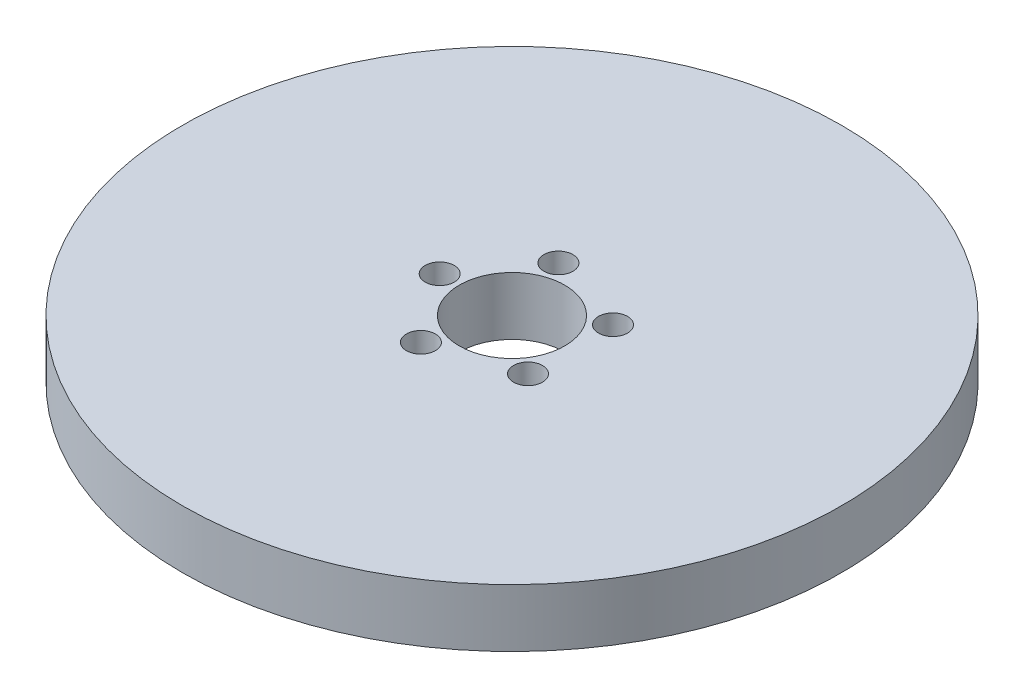
ISO-10303-21;
HEADER;
FILE_DESCRIPTION(('STEP AP214'),'2;1');
FILE_NAME('part.step','',(''),(''),'','','');
FILE_SCHEMA(('AUTOMOTIVE_DESIGN { 1 0 10303 214 1 1 1 1 }'));
ENDSEC;
DATA;
#1=APPLICATION_CONTEXT('core data for automotive mechanical design processes');
#2=APPLICATION_PROTOCOL_DEFINITION('international standard','automotive_design',2000,#1);
#3=PRODUCT_CONTEXT('',#1,'mechanical');
#4=PRODUCT('Part','Part','',(#3));
#5=PRODUCT_RELATED_PRODUCT_CATEGORY('part','',(#4));
#6=PRODUCT_DEFINITION_FORMATION('','',#4);
#7=PRODUCT_DEFINITION_CONTEXT('part definition',#1,'design');
#8=PRODUCT_DEFINITION('design','',#6,#7);
#9=PRODUCT_DEFINITION_SHAPE('','',#8);
#10=(LENGTH_UNIT() NAMED_UNIT(*) SI_UNIT(.MILLI.,.METRE.));
#11=(NAMED_UNIT(*) PLANE_ANGLE_UNIT() SI_UNIT($,.RADIAN.));
#12=(NAMED_UNIT(*) SI_UNIT($,.STERADIAN.) SOLID_ANGLE_UNIT());
#13=UNCERTAINTY_MEASURE_WITH_UNIT(LENGTH_MEASURE(1.E-05),#10,'distance_accuracy_value','');
#14=(GEOMETRIC_REPRESENTATION_CONTEXT(3) GLOBAL_UNCERTAINTY_ASSIGNED_CONTEXT((#13)) GLOBAL_UNIT_ASSIGNED_CONTEXT((#10,
#11,#12)) REPRESENTATION_CONTEXT('',''));
#15=CARTESIAN_POINT('',(0.,0.,0.));
#16=DIRECTION('',(0.,0.,1.));
#17=DIRECTION('',(1.,0.,0.));
#18=AXIS2_PLACEMENT_3D('',#15,#16,#17);
#19=CARTESIAN_POINT('',(0.,11.,0.));
#20=DIRECTION('',(0.,-1.,0.));
#21=DIRECTION('',(0.,0.,-1.));
#22=AXIS2_PLACEMENT_3D('',#19,#20,#21);
#23=CYLINDRICAL_SURFACE('',#22,62.5);
#24=CARTESIAN_POINT('',(0.,11.,0.));
#25=DIRECTION('',(0.,1.,0.));
#26=DIRECTION('',(0.,0.,1.));
#27=AXIS2_PLACEMENT_3D('',#24,#25,#26);
#28=CIRCLE('',#27,62.5);
#29=CARTESIAN_POINT('',(0.,11.,62.5));
#30=VERTEX_POINT('',#29);
#31=EDGE_CURVE('E10',#30,#30,#28,.T.);
#32=ORIENTED_EDGE('',*,*,#31,.F.);
#33=EDGE_LOOP('',(#32));
#34=FACE_BOUND('',#33,.T.);
#35=CARTESIAN_POINT('',(0.,0.,0.));
#36=DIRECTION('',(0.,1.,0.));
#37=DIRECTION('',(0.,0.,1.));
#38=AXIS2_PLACEMENT_3D('',#35,#36,#37);
#39=CIRCLE('',#38,62.5);
#40=CARTESIAN_POINT('',(0.,0.,62.5));
#41=VERTEX_POINT('',#40);
#42=EDGE_CURVE('E37',#41,#41,#39,.T.);
#43=ORIENTED_EDGE('',*,*,#42,.T.);
#44=EDGE_LOOP('',(#43));
#45=FACE_BOUND('',#44,.T.);
#46=ADVANCED_FACE('F40',(#34,#45),#23,.T.);
#47=CARTESIAN_POINT('',(0.,11.,0.));
#48=DIRECTION('',(0.,1.,0.));
#49=DIRECTION('',(0.,0.,1.));
#50=AXIS2_PLACEMENT_3D('',#47,#48,#49);
#51=PLANE('',#50);
#52=CARTESIAN_POINT('',(-4.23685071201321,11.,-13.0396856858318));
#53=DIRECTION('',(0.,1.,0.));
#54=DIRECTION('',(-0.95105651629515,0.,0.309016994374958));
#55=AXIS2_PLACEMENT_3D('',#52,#53,#54);
#56=CIRCLE('',#55,2.75123844064735);
#57=CARTESIAN_POINT('',(-6.85343395887258,11.,-12.1895062520941));
#58=VERTEX_POINT('',#57);
#59=EDGE_CURVE('E70',#58,#58,#56,.T.);
#60=ORIENTED_EDGE('',*,*,#59,.F.);
#61=EDGE_LOOP('',(#60));
#62=FACE_BOUND('',#61,.T.);
#63=CARTESIAN_POINT('',(11.0922191693093,11.,-8.05896895645966));
#64=DIRECTION('',(0.,1.,0.));
#65=DIRECTION('',(-0.58778525229248,0.,-0.809016994374942));
#66=AXIS2_PLACEMENT_3D('',#63,#64,#65);
#67=CIRCLE('',#66,2.75123844064735);
#68=CARTESIAN_POINT('',(9.47508178835664,11.,-10.284767610521));
#69=VERTEX_POINT('',#68);
#70=EDGE_CURVE('E71',#69,#69,#67,.T.);
#71=ORIENTED_EDGE('',*,*,#70,.F.);
#72=EDGE_LOOP('',(#71));
#73=FACE_BOUND('',#72,.T.);
#74=CARTESIAN_POINT('',(11.0922191693094,11.,8.0589689564595));
#75=DIRECTION('',(0.,1.,0.));
#76=DIRECTION('',(0.587785252292469,0.,-0.809016994374951));
#77=AXIS2_PLACEMENT_3D('',#74,#75,#76);
#78=CIRCLE('',#77,2.75123844064735);
#79=CARTESIAN_POINT('',(12.7093565502621,11.,5.83317030239816));
#80=VERTEX_POINT('',#79);
#81=EDGE_CURVE('E78',#80,#80,#78,.T.);
#82=ORIENTED_EDGE('',*,*,#81,.F.);
#83=EDGE_LOOP('',(#82));
#84=FACE_BOUND('',#83,.T.);
#85=CARTESIAN_POINT('',(-4.23685071201302,11.,13.0396856858319));
#86=DIRECTION('',(0.,1.,0.));
#87=DIRECTION('',(0.951056516295155,0.,0.309016994374945));
#88=AXIS2_PLACEMENT_3D('',#85,#86,#87);
#89=CIRCLE('',#88,2.75123844064735);
#90=CARTESIAN_POINT('',(-1.62026746515365,11.,13.8898651195695));
#91=VERTEX_POINT('',#90);
#92=EDGE_CURVE('E61',#91,#91,#89,.T.);
#93=ORIENTED_EDGE('',*,*,#92,.F.);
#94=EDGE_LOOP('',(#93));
#95=FACE_BOUND('',#94,.T.);
#96=CARTESIAN_POINT('',(-13.7107369145927,11.,0.));
#97=DIRECTION('',(0.,1.,0.));
#98=DIRECTION('',(0.,0.,1.));
#99=AXIS2_PLACEMENT_3D('',#96,#97,#98);
#100=CIRCLE('',#99,2.75123844064735);
#101=CARTESIAN_POINT('',(-13.7107369145927,11.,2.75123844064735));
#102=VERTEX_POINT('',#101);
#103=EDGE_CURVE('E54',#102,#102,#100,.T.);
#104=ORIENTED_EDGE('',*,*,#103,.F.);
#105=EDGE_LOOP('',(#104));
#106=FACE_BOUND('',#105,.T.);
#107=CARTESIAN_POINT('',(0.,11.,0.));
#108=DIRECTION('',(0.,1.,0.));
#109=DIRECTION('',(0.,0.,1.));
#110=AXIS2_PLACEMENT_3D('',#107,#108,#109);
#111=CIRCLE('',#110,10.);
#112=CARTESIAN_POINT('',(0.,11.,10.));
#113=VERTEX_POINT('',#112);
#114=EDGE_CURVE('E50',#113,#113,#111,.T.);
#115=ORIENTED_EDGE('',*,*,#114,.F.);
#116=EDGE_LOOP('',(#115));
#117=FACE_BOUND('',#116,.T.);
#118=ORIENTED_EDGE('',*,*,#31,.T.);
#119=EDGE_LOOP('',(#118));
#120=FACE_BOUND('',#119,.T.);
#121=ADVANCED_FACE('F94',(#62,#73,#84,#95,#106,#117,#120),#51,.T.);
#122=CARTESIAN_POINT('',(0.,0.,0.));
#123=DIRECTION('',(0.,1.,0.));
#124=DIRECTION('',(0.,0.,1.));
#125=AXIS2_PLACEMENT_3D('',#122,#123,#124);
#126=PLANE('',#125);
#127=CARTESIAN_POINT('',(0.,0.,0.));
#128=DIRECTION('',(0.,1.,0.));
#129=DIRECTION('',(0.,0.,1.));
#130=AXIS2_PLACEMENT_3D('',#127,#128,#129);
#131=CIRCLE('',#130,10.);
#132=CARTESIAN_POINT('',(0.,0.,10.));
#133=VERTEX_POINT('',#132);
#134=EDGE_CURVE('E47',#133,#133,#131,.T.);
#135=ORIENTED_EDGE('',*,*,#134,.T.);
#136=EDGE_LOOP('',(#135));
#137=FACE_BOUND('',#136,.T.);
#138=ORIENTED_EDGE('',*,*,#42,.F.);
#139=EDGE_LOOP('',(#138));
#140=FACE_BOUND('',#139,.T.);
#141=ADVANCED_FACE('F100',(#137,#140),#126,.F.);
#142=CARTESIAN_POINT('',(0.,11.,0.));
#143=DIRECTION('',(0.,-1.,0.));
#144=DIRECTION('',(0.,0.,-1.));
#145=AXIS2_PLACEMENT_3D('',#142,#143,#144);
#146=CYLINDRICAL_SURFACE('',#145,10.);
#147=ORIENTED_EDGE('',*,*,#114,.T.);
#148=EDGE_LOOP('',(#147));
#149=FACE_BOUND('',#148,.T.);
#150=ORIENTED_EDGE('',*,*,#134,.F.);
#151=EDGE_LOOP('',(#150));
#152=FACE_BOUND('',#151,.T.);
#153=ADVANCED_FACE('F106',(#149,#152),#146,.F.);
#154=CARTESIAN_POINT('',(-13.7107369145927,0.277911017876031,0.));
#155=DIRECTION('',(0.,1.,0.));
#156=DIRECTION('',(0.,0.,1.));
#157=AXIS2_PLACEMENT_3D('',#154,#155,#156);
#158=CYLINDRICAL_SURFACE('',#157,2.75123844064735);
#159=CARTESIAN_POINT('',(-13.7107369145927,0.277911017876031,0.));
#160=DIRECTION('',(0.,1.,0.));
#161=DIRECTION('',(0.,0.,1.));
#162=AXIS2_PLACEMENT_3D('',#159,#160,#161);
#163=CIRCLE('',#162,2.75123844064735);
#164=CARTESIAN_POINT('',(-13.7107369145927,0.277911017876031,2.75123844064735));
#165=VERTEX_POINT('',#164);
#166=EDGE_CURVE('E55',#165,#165,#163,.T.);
#167=ORIENTED_EDGE('',*,*,#166,.F.);
#168=EDGE_LOOP('',(#167));
#169=FACE_BOUND('',#168,.T.);
#170=ORIENTED_EDGE('',*,*,#103,.T.);
#171=EDGE_LOOP('',(#170));
#172=FACE_BOUND('',#171,.T.);
#173=ADVANCED_FACE('F108',(#169,#172),#158,.F.);
#174=CARTESIAN_POINT('',(-13.7107369145927,0.277911017876031,0.));
#175=DIRECTION('',(0.,1.,0.));
#176=DIRECTION('',(0.,0.,1.));
#177=AXIS2_PLACEMENT_3D('',#174,#175,#176);
#178=PLANE('',#177);
#179=ORIENTED_EDGE('',*,*,#166,.T.);
#180=EDGE_LOOP('',(#179));
#181=FACE_BOUND('',#180,.T.);
#182=ADVANCED_FACE('F138',(#181),#178,.T.);
#183=CARTESIAN_POINT('',(-4.23685071201302,0.277911017876031,13.0396856858319));
#184=DIRECTION('',(0.,1.,0.));
#185=DIRECTION('',(0.,0.,1.));
#186=AXIS2_PLACEMENT_3D('',#183,#184,#185);
#187=CYLINDRICAL_SURFACE('',#186,2.75123844064735);
#188=CARTESIAN_POINT('',(-4.23685071201302,0.277911017876031,13.0396856858319));
#189=DIRECTION('',(0.,1.,0.));
#190=DIRECTION('',(0.951056516295155,0.,0.309016994374945));
#191=AXIS2_PLACEMENT_3D('',#188,#189,#190);
#192=CIRCLE('',#191,2.75123844064735);
#193=CARTESIAN_POINT('',(-1.62026746515365,0.277911017876031,13.8898651195695));
#194=VERTEX_POINT('',#193);
#195=EDGE_CURVE('E59',#194,#194,#192,.T.);
#196=ORIENTED_EDGE('',*,*,#195,.F.);
#197=EDGE_LOOP('',(#196));
#198=FACE_BOUND('',#197,.T.);
#199=ORIENTED_EDGE('',*,*,#92,.T.);
#200=EDGE_LOOP('',(#199));
#201=FACE_BOUND('',#200,.T.);
#202=ADVANCED_FACE('F150',(#198,#201),#187,.F.);
#203=CARTESIAN_POINT('',(-4.23685071201302,0.277911017876031,13.0396856858319));
#204=DIRECTION('',(0.,1.,0.));
#205=DIRECTION('',(0.951056516295155,0.,0.309016994374945));
#206=AXIS2_PLACEMENT_3D('',#203,#204,#205);
#207=PLANE('',#206);
#208=ORIENTED_EDGE('',*,*,#195,.T.);
#209=EDGE_LOOP('',(#208));
#210=FACE_BOUND('',#209,.T.);
#211=ADVANCED_FACE('F89',(#210),#207,.T.);
#212=CARTESIAN_POINT('',(11.0922191693094,0.277911017876031,8.0589689564595));
#213=DIRECTION('',(0.,1.,0.));
#214=DIRECTION('',(0.,0.,1.));
#215=AXIS2_PLACEMENT_3D('',#212,#213,#214);
#216=CYLINDRICAL_SURFACE('',#215,2.75123844064735);
#217=CARTESIAN_POINT('',(11.0922191693094,0.277911017876031,8.0589689564595));
#218=DIRECTION('',(0.,1.,0.));
#219=DIRECTION('',(0.587785252292469,0.,-0.809016994374951));
#220=AXIS2_PLACEMENT_3D('',#217,#218,#219);
#221=CIRCLE('',#220,2.75123844064735);
#222=CARTESIAN_POINT('',(12.7093565502621,0.277911017876031,5.83317030239816));
#223=VERTEX_POINT('',#222);
#224=EDGE_CURVE('E63',#223,#223,#221,.T.);
#225=ORIENTED_EDGE('',*,*,#224,.F.);
#226=EDGE_LOOP('',(#225));
#227=FACE_BOUND('',#226,.T.);
#228=ORIENTED_EDGE('',*,*,#81,.T.);
#229=EDGE_LOOP('',(#228));
#230=FACE_BOUND('',#229,.T.);
#231=ADVANCED_FACE('F87',(#227,#230),#216,.F.);
#232=CARTESIAN_POINT('',(11.0922191693094,0.277911017876031,8.0589689564595));
#233=DIRECTION('',(0.,1.,0.));
#234=DIRECTION('',(0.587785252292469,0.,-0.809016994374951));
#235=AXIS2_PLACEMENT_3D('',#232,#233,#234);
#236=PLANE('',#235);
#237=ORIENTED_EDGE('',*,*,#224,.T.);
#238=EDGE_LOOP('',(#237));
#239=FACE_BOUND('',#238,.T.);
#240=ADVANCED_FACE('F84',(#239),#236,.T.);
#241=CARTESIAN_POINT('',(11.0922191693093,0.277911017876031,-8.05896895645966));
#242=DIRECTION('',(0.,1.,0.));
#243=DIRECTION('',(0.,0.,1.));
#244=AXIS2_PLACEMENT_3D('',#241,#242,#243);
#245=CYLINDRICAL_SURFACE('',#244,2.75123844064735);
#246=CARTESIAN_POINT('',(11.0922191693093,0.277911017876031,-8.05896895645966));
#247=DIRECTION('',(0.,1.,0.));
#248=DIRECTION('',(-0.58778525229248,0.,-0.809016994374942));
#249=AXIS2_PLACEMENT_3D('',#246,#247,#248);
#250=CIRCLE('',#249,2.75123844064735);
#251=CARTESIAN_POINT('',(9.47508178835664,0.277911017876031,-10.284767610521));
#252=VERTEX_POINT('',#251);
#253=EDGE_CURVE('E76',#252,#252,#250,.T.);
#254=ORIENTED_EDGE('',*,*,#253,.F.);
#255=EDGE_LOOP('',(#254));
#256=FACE_BOUND('',#255,.T.);
#257=ORIENTED_EDGE('',*,*,#70,.T.);
#258=EDGE_LOOP('',(#257));
#259=FACE_BOUND('',#258,.T.);
#260=ADVANCED_FACE('F185',(#256,#259),#245,.F.);
#261=CARTESIAN_POINT('',(11.0922191693093,0.277911017876031,-8.05896895645966));
#262=DIRECTION('',(0.,1.,0.));
#263=DIRECTION('',(-0.58778525229248,0.,-0.809016994374942));
#264=AXIS2_PLACEMENT_3D('',#261,#262,#263);
#265=PLANE('',#264);
#266=ORIENTED_EDGE('',*,*,#253,.T.);
#267=EDGE_LOOP('',(#266));
#268=FACE_BOUND('',#267,.T.);
#269=ADVANCED_FACE('F189',(#268),#265,.T.);
#270=CARTESIAN_POINT('',(-4.23685071201321,0.277911017876031,-13.0396856858318));
#271=DIRECTION('',(0.,1.,0.));
#272=DIRECTION('',(0.,0.,1.));
#273=AXIS2_PLACEMENT_3D('',#270,#271,#272);
#274=CYLINDRICAL_SURFACE('',#273,2.75123844064735);
#275=CARTESIAN_POINT('',(-4.23685071201321,0.277911017876031,-13.0396856858318));
#276=DIRECTION('',(0.,1.,0.));
#277=DIRECTION('',(-0.95105651629515,0.,0.309016994374958));
#278=AXIS2_PLACEMENT_3D('',#275,#276,#277);
#279=CIRCLE('',#278,2.75123844064735);
#280=CARTESIAN_POINT('',(-6.85343395887258,0.277911017876031,-12.1895062520941));
#281=VERTEX_POINT('',#280);
#282=EDGE_CURVE('E69',#281,#281,#279,.T.);
#283=ORIENTED_EDGE('',*,*,#282,.F.);
#284=EDGE_LOOP('',(#283));
#285=FACE_BOUND('',#284,.T.);
#286=ORIENTED_EDGE('',*,*,#59,.T.);
#287=EDGE_LOOP('',(#286));
#288=FACE_BOUND('',#287,.T.);
#289=ADVANCED_FACE('F200',(#285,#288),#274,.F.);
#290=CARTESIAN_POINT('',(-4.23685071201321,0.277911017876031,-13.0396856858318));
#291=DIRECTION('',(0.,1.,0.));
#292=DIRECTION('',(-0.95105651629515,0.,0.309016994374958));
#293=AXIS2_PLACEMENT_3D('',#290,#291,#292);
#294=PLANE('',#293);
#295=ORIENTED_EDGE('',*,*,#282,.T.);
#296=EDGE_LOOP('',(#295));
#297=FACE_BOUND('',#296,.T.);
#298=ADVANCED_FACE('F208',(#297),#294,.T.);
#299=CLOSED_SHELL('',(#46,#121,#141,#153,#173,#182,#202,#211,#231,#240,#260,#269,#289,#298));
#300=MANIFOLD_SOLID_BREP('B2',#299);
#301=ADVANCED_BREP_SHAPE_REPRESENTATION('',(#18,#300),#14);
#302=SHAPE_DEFINITION_REPRESENTATION(#9,#301);
ENDSEC;
END-ISO-10303-21;
